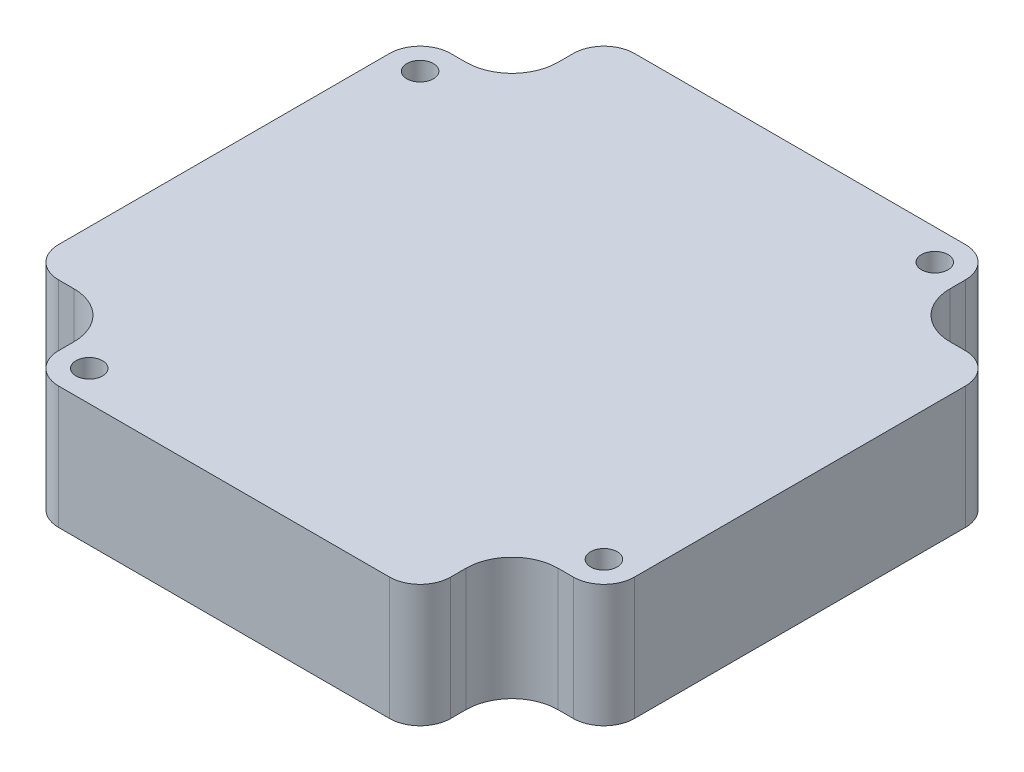
ISO-10303-21;
HEADER;
FILE_DESCRIPTION(('STEP AP214'),'2;1');
FILE_NAME('part.step','',(''),(''),'','','');
FILE_SCHEMA(('AUTOMOTIVE_DESIGN { 1 0 10303 214 1 1 1 1 }'));
ENDSEC;
DATA;
#1=APPLICATION_CONTEXT('core data for automotive mechanical design processes');
#2=APPLICATION_PROTOCOL_DEFINITION('international standard','automotive_design',2000,#1);
#3=PRODUCT_CONTEXT('',#1,'mechanical');
#4=PRODUCT('Part','Part','',(#3));
#5=PRODUCT_RELATED_PRODUCT_CATEGORY('part','',(#4));
#6=PRODUCT_DEFINITION_FORMATION('','',#4);
#7=PRODUCT_DEFINITION_CONTEXT('part definition',#1,'design');
#8=PRODUCT_DEFINITION('design','',#6,#7);
#9=PRODUCT_DEFINITION_SHAPE('','',#8);
#10=(LENGTH_UNIT() NAMED_UNIT(*) SI_UNIT(.MILLI.,.METRE.));
#11=(NAMED_UNIT(*) PLANE_ANGLE_UNIT() SI_UNIT($,.RADIAN.));
#12=(NAMED_UNIT(*) SI_UNIT($,.STERADIAN.) SOLID_ANGLE_UNIT());
#13=UNCERTAINTY_MEASURE_WITH_UNIT(LENGTH_MEASURE(1.E-05),#10,'distance_accuracy_value','');
#14=(GEOMETRIC_REPRESENTATION_CONTEXT(3) GLOBAL_UNCERTAINTY_ASSIGNED_CONTEXT((#13)) GLOBAL_UNIT_ASSIGNED_CONTEXT((#10,
#11,#12)) REPRESENTATION_CONTEXT('',''));
#15=CARTESIAN_POINT('',(0.,0.,0.));
#16=DIRECTION('',(0.,0.,1.));
#17=DIRECTION('',(1.,0.,0.));
#18=AXIS2_PLACEMENT_3D('',#15,#16,#17);
#19=CARTESIAN_POINT('',(0.,-62.7,0.));
#20=DIRECTION('',(0.,-1.,0.));
#21=DIRECTION('',(0.,0.,-1.));
#22=AXIS2_PLACEMENT_3D('',#19,#20,#21);
#23=PLANE('',#22);
#24=CARTESIAN_POINT('',(0.,-62.7,0.));
#25=DIRECTION('',(0.,-1.,0.));
#26=DIRECTION('',(0.,0.,-1.));
#27=AXIS2_PLACEMENT_3D('',#24,#25,#26);
#28=CIRCLE('',#27,5.);
#29=CARTESIAN_POINT('',(0.,-62.7,-5.));
#30=VERTEX_POINT('',#29);
#31=EDGE_CURVE('E20',#30,#30,#28,.T.);
#32=ORIENTED_EDGE('',*,*,#31,.T.);
#33=EDGE_LOOP('',(#32));
#34=FACE_BOUND('',#33,.T.);
#35=ADVANCED_FACE('F17',(#34),#23,.T.);
#36=CARTESIAN_POINT('',(0.,-62.7,0.));
#37=DIRECTION('',(0.,-1.,0.));
#38=DIRECTION('',(0.,0.,-1.));
#39=AXIS2_PLACEMENT_3D('',#36,#37,#38);
#40=CYLINDRICAL_SURFACE('',#39,5.);
#41=CARTESIAN_POINT('',(0.,-65.,0.));
#42=DIRECTION('',(0.,-1.,0.));
#43=DIRECTION('',(0.,0.,-1.));
#44=AXIS2_PLACEMENT_3D('',#41,#42,#43);
#45=CIRCLE('',#44,5.);
#46=CARTESIAN_POINT('',(0.,-65.,-5.));
#47=VERTEX_POINT('',#46);
#48=EDGE_CURVE('E227',#47,#47,#45,.F.);
#49=ORIENTED_EDGE('',*,*,#48,.F.);
#50=EDGE_LOOP('',(#49));
#51=FACE_BOUND('',#50,.T.);
#52=ORIENTED_EDGE('',*,*,#31,.F.);
#53=EDGE_LOOP('',(#52));
#54=FACE_BOUND('',#53,.T.);
#55=ADVANCED_FACE('F358',(#51,#54),#40,.F.);
#56=CARTESIAN_POINT('',(-19.2,-65.,25.2));
#57=DIRECTION('',(1.,0.,0.));
#58=DIRECTION('',(0.,0.,-1.));
#59=AXIS2_PLACEMENT_3D('',#56,#57,#58);
#60=PLANE('',#59);
#61=DIRECTION('',(0.,1.,0.));
#62=VECTOR('',#61,1.);
#63=CARTESIAN_POINT('',(-19.2,-65.,23.7));
#64=LINE('',#63,#62);
#65=CARTESIAN_POINT('',(-19.2,-53.,23.7));
#66=VERTEX_POINT('',#65);
#67=CARTESIAN_POINT('',(-19.2,-65.,23.7));
#68=VERTEX_POINT('',#67);
#69=EDGE_CURVE('E202',#66,#68,#64,.F.);
#70=ORIENTED_EDGE('',*,*,#69,.T.);
#71=DIRECTION('',(0.,0.,-1.));
#72=VECTOR('',#71,1.);
#73=CARTESIAN_POINT('',(-19.2,-65.,25.1999999999999));
#74=LINE('',#73,#72);
#75=CARTESIAN_POINT('',(-19.2,-65.,25.2));
#76=VERTEX_POINT('',#75);
#77=EDGE_CURVE('E226',#76,#68,#74,.T.);
#78=ORIENTED_EDGE('',*,*,#77,.F.);
#79=DIRECTION('',(0.,1.,0.));
#80=VECTOR('',#79,1.);
#81=CARTESIAN_POINT('',(-19.2,-65.,25.2));
#82=LINE('',#81,#80);
#83=CARTESIAN_POINT('',(-19.2,-53.,25.2));
#84=VERTEX_POINT('',#83);
#85=EDGE_CURVE('E176',#84,#76,#82,.F.);
#86=ORIENTED_EDGE('',*,*,#85,.F.);
#87=DIRECTION('',(0.,0.,-1.));
#88=VECTOR('',#87,1.);
#89=CARTESIAN_POINT('',(-19.2,-53.,25.2));
#90=LINE('',#89,#88);
#91=EDGE_CURVE('E256',#66,#84,#90,.F.);
#92=ORIENTED_EDGE('',*,*,#91,.F.);
#93=EDGE_LOOP('',(#70,#78,#86,#92));
#94=FACE_BOUND('',#93,.T.);
#95=ADVANCED_FACE('F361',(#94),#60,.F.);
#96=CARTESIAN_POINT('',(-23.7,-65.,19.2));
#97=DIRECTION('',(0.,0.,-1.));
#98=DIRECTION('',(-1.,0.,0.));
#99=AXIS2_PLACEMENT_3D('',#96,#97,#98);
#100=PLANE('',#99);
#101=DIRECTION('',(0.,1.,0.));
#102=VECTOR('',#101,1.);
#103=CARTESIAN_POINT('',(-25.2,-65.,19.2));
#104=LINE('',#103,#102);
#105=CARTESIAN_POINT('',(-25.2,-65.,19.2));
#106=VERTEX_POINT('',#105);
#107=CARTESIAN_POINT('',(-25.2,-53.,19.2));
#108=VERTEX_POINT('',#107);
#109=EDGE_CURVE('E341',#106,#108,#104,.T.);
#110=ORIENTED_EDGE('',*,*,#109,.F.);
#111=DIRECTION('',(1.,0.,0.));
#112=VECTOR('',#111,1.);
#113=CARTESIAN_POINT('',(16.2000000000001,-65.,19.2));
#114=LINE('',#113,#112);
#115=CARTESIAN_POINT('',(-23.7,-65.,19.2));
#116=VERTEX_POINT('',#115);
#117=EDGE_CURVE('E224',#116,#106,#114,.F.);
#118=ORIENTED_EDGE('',*,*,#117,.F.);
#119=DIRECTION('',(0.,1.,0.));
#120=VECTOR('',#119,1.);
#121=CARTESIAN_POINT('',(-23.7,-65.,19.2));
#122=LINE('',#121,#120);
#123=CARTESIAN_POINT('',(-23.7,-53.,19.2));
#124=VERTEX_POINT('',#123);
#125=EDGE_CURVE('E342',#116,#124,#122,.T.);
#126=ORIENTED_EDGE('',*,*,#125,.T.);
#127=DIRECTION('',(-1.,0.,0.));
#128=VECTOR('',#127,1.);
#129=CARTESIAN_POINT('',(-23.7,-53.,19.2));
#130=LINE('',#129,#128);
#131=EDGE_CURVE('E249',#108,#124,#130,.F.);
#132=ORIENTED_EDGE('',*,*,#131,.F.);
#133=EDGE_LOOP('',(#110,#118,#126,#132));
#134=FACE_BOUND('',#133,.T.);
#135=ADVANCED_FACE('F477',(#134),#100,.F.);
#136=CARTESIAN_POINT('',(-25.2000000000002,-65.,-19.1999999999996));
#137=DIRECTION('',(0.,0.,1.));
#138=DIRECTION('',(1.,0.,0.));
#139=AXIS2_PLACEMENT_3D('',#136,#137,#138);
#140=PLANE('',#139);
#141=DIRECTION('',(0.,1.,0.));
#142=VECTOR('',#141,1.);
#143=CARTESIAN_POINT('',(-23.7000000000003,-65.,-19.1999999999997));
#144=LINE('',#143,#142);
#145=CARTESIAN_POINT('',(-23.7000000000001,-53.,-19.1999999999997));
#146=VERTEX_POINT('',#145);
#147=CARTESIAN_POINT('',(-23.7000000000003,-65.,-19.1999999999997));
#148=VERTEX_POINT('',#147);
#149=EDGE_CURVE('E334',#146,#148,#144,.F.);
#150=ORIENTED_EDGE('',*,*,#149,.T.);
#151=DIRECTION('',(1.,0.,0.));
#152=VECTOR('',#151,1.);
#153=CARTESIAN_POINT('',(16.2000000000001,-65.,-19.1999999999996));
#154=LINE('',#153,#152);
#155=CARTESIAN_POINT('',(-25.2000000000002,-65.,-19.1999999999996));
#156=VERTEX_POINT('',#155);
#157=EDGE_CURVE('E222',#156,#148,#154,.T.);
#158=ORIENTED_EDGE('',*,*,#157,.F.);
#159=DIRECTION('',(0.,1.,0.));
#160=VECTOR('',#159,1.);
#161=CARTESIAN_POINT('',(-25.2000000000002,-65.,-19.1999999999996));
#162=LINE('',#161,#160);
#163=CARTESIAN_POINT('',(-25.2000000000003,-53.,-19.1999999999996));
#164=VERTEX_POINT('',#163);
#165=EDGE_CURVE('E253',#164,#156,#162,.F.);
#166=ORIENTED_EDGE('',*,*,#165,.F.);
#167=DIRECTION('',(1.,0.,0.));
#168=VECTOR('',#167,1.);
#169=CARTESIAN_POINT('',(-25.2000000000002,-53.,-19.1999999999996));
#170=LINE('',#169,#168);
#171=EDGE_CURVE('E247',#146,#164,#170,.F.);
#172=ORIENTED_EDGE('',*,*,#171,.F.);
#173=EDGE_LOOP('',(#150,#158,#166,#172));
#174=FACE_BOUND('',#173,.T.);
#175=ADVANCED_FACE('F473',(#174),#140,.F.);
#176=CARTESIAN_POINT('',(-19.2000000000003,-65.,-23.6999999999998));
#177=DIRECTION('',(1.,0.,0.));
#178=DIRECTION('',(0.,0.,-1.));
#179=AXIS2_PLACEMENT_3D('',#176,#177,#178);
#180=PLANE('',#179);
#181=DIRECTION('',(0.,1.,0.));
#182=VECTOR('',#181,1.);
#183=CARTESIAN_POINT('',(-19.2000000000003,-65.,-25.1999999999998));
#184=LINE('',#183,#182);
#185=CARTESIAN_POINT('',(-19.2000000000003,-65.,-25.1999999999998));
#186=VERTEX_POINT('',#185);
#187=CARTESIAN_POINT('',(-19.2000000000003,-53.,-25.1999999999998));
#188=VERTEX_POINT('',#187);
#189=EDGE_CURVE('E329',#186,#188,#184,.T.);
#190=ORIENTED_EDGE('',*,*,#189,.F.);
#191=DIRECTION('',(0.,0.,-1.));
#192=VECTOR('',#191,1.);
#193=CARTESIAN_POINT('',(-19.2000000000003,-65.,25.1999999999999));
#194=LINE('',#193,#192);
#195=CARTESIAN_POINT('',(-19.2000000000003,-65.,-23.6999999999998));
#196=VERTEX_POINT('',#195);
#197=EDGE_CURVE('E220',#196,#186,#194,.T.);
#198=ORIENTED_EDGE('',*,*,#197,.F.);
#199=DIRECTION('',(0.,1.,0.));
#200=VECTOR('',#199,1.);
#201=CARTESIAN_POINT('',(-19.2000000000003,-65.,-23.6999999999998));
#202=LINE('',#201,#200);
#203=CARTESIAN_POINT('',(-19.2000000000003,-53.,-23.6999999999999));
#204=VERTEX_POINT('',#203);
#205=EDGE_CURVE('E330',#196,#204,#202,.T.);
#206=ORIENTED_EDGE('',*,*,#205,.T.);
#207=DIRECTION('',(0.,0.,-1.));
#208=VECTOR('',#207,1.);
#209=CARTESIAN_POINT('',(-19.2000000000003,-53.,-23.6999999999998));
#210=LINE('',#209,#208);
#211=EDGE_CURVE('E240',#188,#204,#210,.F.);
#212=ORIENTED_EDGE('',*,*,#211,.F.);
#213=EDGE_LOOP('',(#190,#198,#206,#212));
#214=FACE_BOUND('',#213,.T.);
#215=ADVANCED_FACE('F469',(#214),#180,.F.);
#216=CARTESIAN_POINT('',(19.1999999999997,-65.,-25.2000000000001));
#217=DIRECTION('',(-1.,0.,0.));
#218=DIRECTION('',(0.,0.,1.));
#219=AXIS2_PLACEMENT_3D('',#216,#217,#218);
#220=PLANE('',#219);
#221=DIRECTION('',(0.,1.,0.));
#222=VECTOR('',#221,1.);
#223=CARTESIAN_POINT('',(19.1999999999998,-65.,-23.7000000000001));
#224=LINE('',#223,#222);
#225=CARTESIAN_POINT('',(19.1999999999998,-53.,-23.7));
#226=VERTEX_POINT('',#225);
#227=CARTESIAN_POINT('',(19.1999999999998,-65.,-23.7000000000002));
#228=VERTEX_POINT('',#227);
#229=EDGE_CURVE('E322',#226,#228,#224,.F.);
#230=ORIENTED_EDGE('',*,*,#229,.T.);
#231=DIRECTION('',(0.,0.,-1.));
#232=VECTOR('',#231,1.);
#233=CARTESIAN_POINT('',(19.1999999999997,-65.,25.1999999999999));
#234=LINE('',#233,#232);
#235=CARTESIAN_POINT('',(19.1999999999997,-65.,-25.2000000000001));
#236=VERTEX_POINT('',#235);
#237=EDGE_CURVE('E218',#236,#228,#234,.F.);
#238=ORIENTED_EDGE('',*,*,#237,.F.);
#239=DIRECTION('',(0.,1.,0.));
#240=VECTOR('',#239,1.);
#241=CARTESIAN_POINT('',(19.1999999999997,-65.,-25.2000000000001));
#242=LINE('',#241,#240);
#243=CARTESIAN_POINT('',(19.1999999999997,-53.,-25.2000000000002));
#244=VERTEX_POINT('',#243);
#245=EDGE_CURVE('E244',#244,#236,#242,.F.);
#246=ORIENTED_EDGE('',*,*,#245,.F.);
#247=DIRECTION('',(0.,0.,1.));
#248=VECTOR('',#247,1.);
#249=CARTESIAN_POINT('',(19.1999999999997,-53.,-25.2000000000001));
#250=LINE('',#249,#248);
#251=EDGE_CURVE('E238',#226,#244,#250,.F.);
#252=ORIENTED_EDGE('',*,*,#251,.F.);
#253=EDGE_LOOP('',(#230,#238,#246,#252));
#254=FACE_BOUND('',#253,.T.);
#255=ADVANCED_FACE('F465',(#254),#220,.F.);
#256=CARTESIAN_POINT('',(23.6999999999999,-65.,-19.2000000000002));
#257=DIRECTION('',(0.,0.,1.));
#258=DIRECTION('',(1.,0.,0.));
#259=AXIS2_PLACEMENT_3D('',#256,#257,#258);
#260=PLANE('',#259);
#261=DIRECTION('',(0.,1.,0.));
#262=VECTOR('',#261,1.);
#263=CARTESIAN_POINT('',(25.1999999999999,-65.,-19.2000000000002));
#264=LINE('',#263,#262);
#265=CARTESIAN_POINT('',(25.1999999999999,-65.,-19.2000000000002));
#266=VERTEX_POINT('',#265);
#267=CARTESIAN_POINT('',(25.1999999999998,-53.,-19.2000000000002));
#268=VERTEX_POINT('',#267);
#269=EDGE_CURVE('E317',#266,#268,#264,.T.);
#270=ORIENTED_EDGE('',*,*,#269,.F.);
#271=DIRECTION('',(1.,0.,0.));
#272=VECTOR('',#271,1.);
#273=CARTESIAN_POINT('',(16.2000000000001,-65.,-19.2000000000002));
#274=LINE('',#273,#272);
#275=CARTESIAN_POINT('',(23.6999999999998,-65.,-19.2000000000002));
#276=VERTEX_POINT('',#275);
#277=EDGE_CURVE('E216',#276,#266,#274,.T.);
#278=ORIENTED_EDGE('',*,*,#277,.F.);
#279=DIRECTION('',(0.,1.,0.));
#280=VECTOR('',#279,1.);
#281=CARTESIAN_POINT('',(23.6999999999998,-65.,-19.2000000000002));
#282=LINE('',#281,#280);
#283=CARTESIAN_POINT('',(23.6999999999999,-53.,-19.2000000000002));
#284=VERTEX_POINT('',#283);
#285=EDGE_CURVE('E318',#276,#284,#282,.T.);
#286=ORIENTED_EDGE('',*,*,#285,.T.);
#287=DIRECTION('',(1.,0.,0.));
#288=VECTOR('',#287,1.);
#289=CARTESIAN_POINT('',(23.6999999999999,-53.,-19.2000000000002));
#290=LINE('',#289,#288);
#291=EDGE_CURVE('E231',#268,#284,#290,.F.);
#292=ORIENTED_EDGE('',*,*,#291,.F.);
#293=EDGE_LOOP('',(#270,#278,#286,#292));
#294=FACE_BOUND('',#293,.T.);
#295=ADVANCED_FACE('F461',(#294),#260,.F.);
#296=CARTESIAN_POINT('',(25.2000000000001,-65.,19.1999999999999));
#297=DIRECTION('',(0.,0.,-1.));
#298=DIRECTION('',(-1.,0.,0.));
#299=AXIS2_PLACEMENT_3D('',#296,#297,#298);
#300=PLANE('',#299);
#301=DIRECTION('',(0.,1.,0.));
#302=VECTOR('',#301,1.);
#303=CARTESIAN_POINT('',(23.7000000000001,-65.,19.1999999999999));
#304=LINE('',#303,#302);
#305=CARTESIAN_POINT('',(23.7000000000001,-53.,19.1999999999999));
#306=VERTEX_POINT('',#305);
#307=CARTESIAN_POINT('',(23.7000000000001,-65.,19.1999999999999));
#308=VERTEX_POINT('',#307);
#309=EDGE_CURVE('E310',#306,#308,#304,.F.);
#310=ORIENTED_EDGE('',*,*,#309,.T.);
#311=DIRECTION('',(1.,0.,0.));
#312=VECTOR('',#311,1.);
#313=CARTESIAN_POINT('',(16.2000000000001,-65.,19.1999999999999));
#314=LINE('',#313,#312);
#315=CARTESIAN_POINT('',(25.2000000000001,-65.,19.1999999999999));
#316=VERTEX_POINT('',#315);
#317=EDGE_CURVE('E214',#316,#308,#314,.F.);
#318=ORIENTED_EDGE('',*,*,#317,.F.);
#319=DIRECTION('',(0.,1.,0.));
#320=VECTOR('',#319,1.);
#321=CARTESIAN_POINT('',(25.2000000000001,-65.,19.1999999999999));
#322=LINE('',#321,#320);
#323=CARTESIAN_POINT('',(25.2000000000001,-53.,19.1999999999999));
#324=VERTEX_POINT('',#323);
#325=EDGE_CURVE('E235',#324,#316,#322,.F.);
#326=ORIENTED_EDGE('',*,*,#325,.F.);
#327=DIRECTION('',(-1.,0.,0.));
#328=VECTOR('',#327,1.);
#329=CARTESIAN_POINT('',(25.2000000000001,-53.,19.1999999999999));
#330=LINE('',#329,#328);
#331=EDGE_CURVE('E229',#306,#324,#330,.F.);
#332=ORIENTED_EDGE('',*,*,#331,.F.);
#333=EDGE_LOOP('',(#310,#318,#326,#332));
#334=FACE_BOUND('',#333,.T.);
#335=ADVANCED_FACE('F458',(#334),#300,.F.);
#336=CARTESIAN_POINT('',(16.2000000000001,-65.,25.1999999999999));
#337=DIRECTION('',(0.,-1.,0.));
#338=DIRECTION('',(0.,0.,-1.));
#339=AXIS2_PLACEMENT_3D('',#336,#337,#338);
#340=PLANE('',#339);
#341=CARTESIAN_POINT('',(23.7000000000001,-65.,23.6999999999999));
#342=DIRECTION('',(0.,1.,0.));
#343=DIRECTION('',(0.,0.,1.));
#344=AXIS2_PLACEMENT_3D('',#341,#342,#343);
#345=CIRCLE('',#344,4.5);
#346=CARTESIAN_POINT('',(19.2000000000001,-65.,23.6999999999999));
#347=VERTEX_POINT('',#346);
#348=EDGE_CURVE('E307',#308,#347,#345,.T.);
#349=ORIENTED_EDGE('',*,*,#348,.T.);
#350=DIRECTION('',(0.,0.,1.));
#351=VECTOR('',#350,1.);
#352=CARTESIAN_POINT('',(19.2000000000001,-65.,23.6999999999999));
#353=LINE('',#352,#351);
#354=CARTESIAN_POINT('',(19.2000000000001,-65.,25.1999999999999));
#355=VERTEX_POINT('',#354);
#356=EDGE_CURVE('E212',#347,#355,#353,.T.);
#357=ORIENTED_EDGE('',*,*,#356,.T.);
#358=CARTESIAN_POINT('',(16.2000000000001,-65.,25.1999999999999));
#359=DIRECTION('',(0.,1.,0.));
#360=DIRECTION('',(0.,0.,1.));
#361=AXIS2_PLACEMENT_3D('',#358,#359,#360);
#362=CIRCLE('',#361,3.);
#363=CARTESIAN_POINT('',(16.2000000000001,-65.,28.1999999999999));
#364=VERTEX_POINT('',#363);
#365=EDGE_CURVE('E193',#364,#355,#362,.T.);
#366=ORIENTED_EDGE('',*,*,#365,.F.);
#367=DIRECTION('',(-1.,0.,0.));
#368=VECTOR('',#367,1.);
#369=CARTESIAN_POINT('',(16.2000000000001,-65.,28.1999999999999));
#370=LINE('',#369,#368);
#371=CARTESIAN_POINT('',(-16.2,-65.,28.2));
#372=VERTEX_POINT('',#371);
#373=EDGE_CURVE('E188',#364,#372,#370,.T.);
#374=ORIENTED_EDGE('',*,*,#373,.T.);
#375=CARTESIAN_POINT('',(-16.2,-65.,25.2));
#376=DIRECTION('',(0.,1.,0.));
#377=DIRECTION('',(0.,0.,1.));
#378=AXIS2_PLACEMENT_3D('',#375,#376,#377);
#379=CIRCLE('',#378,3.);
#380=EDGE_CURVE('E179',#76,#372,#379,.T.);
#381=ORIENTED_EDGE('',*,*,#380,.F.);
#382=ORIENTED_EDGE('',*,*,#77,.T.);
#383=CARTESIAN_POINT('',(-23.7,-65.,23.7));
#384=DIRECTION('',(0.,1.,0.));
#385=DIRECTION('',(0.,0.,1.));
#386=AXIS2_PLACEMENT_3D('',#383,#384,#385);
#387=CIRCLE('',#386,4.5);
#388=EDGE_CURVE('E205',#68,#116,#387,.T.);
#389=ORIENTED_EDGE('',*,*,#388,.T.);
#390=ORIENTED_EDGE('',*,*,#117,.T.);
#391=CARTESIAN_POINT('',(-25.2,-65.,16.2));
#392=DIRECTION('',(0.,1.,0.));
#393=DIRECTION('',(0.,0.,1.));
#394=AXIS2_PLACEMENT_3D('',#391,#392,#393);
#395=CIRCLE('',#394,3.);
#396=CARTESIAN_POINT('',(-28.2,-65.,16.2));
#397=VERTEX_POINT('',#396);
#398=EDGE_CURVE('E338',#397,#106,#395,.T.);
#399=ORIENTED_EDGE('',*,*,#398,.F.);
#400=DIRECTION('',(0.,0.,-1.));
#401=VECTOR('',#400,1.);
#402=CARTESIAN_POINT('',(-28.2,-65.,16.2));
#403=LINE('',#402,#401);
#404=CARTESIAN_POINT('',(-28.2,-65.,-16.1999999999997));
#405=VERTEX_POINT('',#404);
#406=EDGE_CURVE('E250',#397,#405,#403,.T.);
#407=ORIENTED_EDGE('',*,*,#406,.T.);
#408=CARTESIAN_POINT('',(-25.2000000000002,-65.,-16.1999999999997));
#409=DIRECTION('',(0.,1.,0.));
#410=DIRECTION('',(0.,0.,1.));
#411=AXIS2_PLACEMENT_3D('',#408,#409,#410);
#412=CIRCLE('',#411,2.99999999999987);
#413=EDGE_CURVE('E335',#156,#405,#412,.T.);
#414=ORIENTED_EDGE('',*,*,#413,.F.);
#415=ORIENTED_EDGE('',*,*,#157,.T.);
#416=CARTESIAN_POINT('',(-23.7000000000003,-65.,-23.6999999999997));
#417=DIRECTION('',(0.,1.,0.));
#418=DIRECTION('',(0.,0.,1.));
#419=AXIS2_PLACEMENT_3D('',#416,#417,#418);
#420=CIRCLE('',#419,4.5);
#421=EDGE_CURVE('E331',#148,#196,#420,.T.);
#422=ORIENTED_EDGE('',*,*,#421,.T.);
#423=ORIENTED_EDGE('',*,*,#197,.T.);
#424=CARTESIAN_POINT('',(-16.2000000000003,-65.,-25.1999999999998));
#425=DIRECTION('',(0.,1.,0.));
#426=DIRECTION('',(0.,0.,1.));
#427=AXIS2_PLACEMENT_3D('',#424,#425,#426);
#428=CIRCLE('',#427,3.00000000000006);
#429=CARTESIAN_POINT('',(-16.2000000000003,-65.,-28.1999999999999));
#430=VERTEX_POINT('',#429);
#431=EDGE_CURVE('E326',#430,#186,#428,.T.);
#432=ORIENTED_EDGE('',*,*,#431,.F.);
#433=DIRECTION('',(1.,0.,0.));
#434=VECTOR('',#433,1.);
#435=CARTESIAN_POINT('',(-16.2000000000003,-65.,-28.1999999999999));
#436=LINE('',#435,#434);
#437=CARTESIAN_POINT('',(16.1999999999998,-65.,-28.2));
#438=VERTEX_POINT('',#437);
#439=EDGE_CURVE('E241',#430,#438,#436,.T.);
#440=ORIENTED_EDGE('',*,*,#439,.T.);
#441=CARTESIAN_POINT('',(16.1999999999998,-65.,-25.2000000000001));
#442=DIRECTION('',(0.,1.,0.));
#443=DIRECTION('',(0.,0.,1.));
#444=AXIS2_PLACEMENT_3D('',#441,#442,#443);
#445=CIRCLE('',#444,2.99999999999991);
#446=EDGE_CURVE('E323',#236,#438,#445,.T.);
#447=ORIENTED_EDGE('',*,*,#446,.F.);
#448=ORIENTED_EDGE('',*,*,#237,.T.);
#449=CARTESIAN_POINT('',(23.6999999999998,-65.,-23.7000000000002));
#450=DIRECTION('',(0.,1.,0.));
#451=DIRECTION('',(0.,0.,1.));
#452=AXIS2_PLACEMENT_3D('',#449,#450,#451);
#453=CIRCLE('',#452,4.5);
#454=EDGE_CURVE('E319',#228,#276,#453,.T.);
#455=ORIENTED_EDGE('',*,*,#454,.T.);
#456=ORIENTED_EDGE('',*,*,#277,.T.);
#457=CARTESIAN_POINT('',(25.1999999999999,-65.,-16.2000000000002));
#458=DIRECTION('',(0.,1.,0.));
#459=DIRECTION('',(0.,0.,1.));
#460=AXIS2_PLACEMENT_3D('',#457,#458,#459);
#461=CIRCLE('',#460,3.00000000000005);
#462=CARTESIAN_POINT('',(28.1999999999999,-65.,-16.2000000000002));
#463=VERTEX_POINT('',#462);
#464=EDGE_CURVE('E314',#463,#266,#461,.T.);
#465=ORIENTED_EDGE('',*,*,#464,.F.);
#466=DIRECTION('',(0.,0.,1.));
#467=VECTOR('',#466,1.);
#468=CARTESIAN_POINT('',(28.1999999999999,-65.,-16.2000000000002));
#469=LINE('',#468,#467);
#470=CARTESIAN_POINT('',(28.2000000000001,-65.,16.1999999999999));
#471=VERTEX_POINT('',#470);
#472=EDGE_CURVE('E232',#463,#471,#469,.T.);
#473=ORIENTED_EDGE('',*,*,#472,.T.);
#474=CARTESIAN_POINT('',(25.2000000000001,-65.,16.1999999999999));
#475=DIRECTION('',(0.,1.,0.));
#476=DIRECTION('',(0.,0.,1.));
#477=AXIS2_PLACEMENT_3D('',#474,#475,#476);
#478=CIRCLE('',#477,3.);
#479=EDGE_CURVE('E311',#316,#471,#478,.T.);
#480=ORIENTED_EDGE('',*,*,#479,.F.);
#481=ORIENTED_EDGE('',*,*,#317,.T.);
#482=EDGE_LOOP('',(#349,#357,#366,#374,#381,#382,#389,#390,#399,#407,#414,#415,#422,#423,#432,
#440,#447,#448,#455,#456,#465,#473,#480,#481));
#483=FACE_BOUND('',#482,.T.);
#484=ORIENTED_EDGE('',*,*,#48,.T.);
#485=EDGE_LOOP('',(#484));
#486=FACE_BOUND('',#485,.T.);
#487=CARTESIAN_POINT('',(-25.199999999999,-65.,-16.2000000000013));
#488=DIRECTION('',(0.,-1.,0.));
#489=DIRECTION('',(0.,0.,-1.));
#490=AXIS2_PLACEMENT_3D('',#487,#488,#489);
#491=CIRCLE('',#490,1.30000000000052);
#492=CARTESIAN_POINT('',(-25.199999999999,-65.,-17.5000000000018));
#493=VERTEX_POINT('',#492);
#494=EDGE_CURVE('E197',#493,#493,#491,.F.);
#495=ORIENTED_EDGE('',*,*,#494,.T.);
#496=EDGE_LOOP('',(#495));
#497=FACE_BOUND('',#496,.T.);
#498=CARTESIAN_POINT('',(-16.2000000000001,-65.,25.1999999999988));
#499=DIRECTION('',(0.,-1.,0.));
#500=DIRECTION('',(0.,0.,-1.));
#501=AXIS2_PLACEMENT_3D('',#498,#499,#500);
#502=CIRCLE('',#501,1.30000000000113);
#503=CARTESIAN_POINT('',(-16.2000000000001,-65.,23.8999999999976));
#504=VERTEX_POINT('',#503);
#505=EDGE_CURVE('E347',#504,#504,#502,.F.);
#506=ORIENTED_EDGE('',*,*,#505,.T.);
#507=EDGE_LOOP('',(#506));
#508=FACE_BOUND('',#507,.T.);
#509=CARTESIAN_POINT('',(16.2000000000011,-65.,-25.2000000000002));
#510=DIRECTION('',(0.,-1.,0.));
#511=DIRECTION('',(0.,0.,-1.));
#512=AXIS2_PLACEMENT_3D('',#509,#510,#511);
#513=CIRCLE('',#512,1.29999999999944);
#514=CARTESIAN_POINT('',(16.2000000000011,-65.,-26.4999999999996));
#515=VERTEX_POINT('',#514);
#516=EDGE_CURVE('E350',#515,#515,#513,.F.);
#517=ORIENTED_EDGE('',*,*,#516,.T.);
#518=EDGE_LOOP('',(#517));
#519=FACE_BOUND('',#518,.T.);
#520=CARTESIAN_POINT('',(25.1999999999999,-65.,16.1999999999999));
#521=DIRECTION('',(0.,-1.,0.));
#522=DIRECTION('',(0.,0.,-1.));
#523=AXIS2_PLACEMENT_3D('',#520,#521,#522);
#524=CIRCLE('',#523,1.3);
#525=CARTESIAN_POINT('',(25.1999999999999,-65.,14.8999999999999));
#526=VERTEX_POINT('',#525);
#527=EDGE_CURVE('E211',#526,#526,#524,.F.);
#528=ORIENTED_EDGE('',*,*,#527,.T.);
#529=EDGE_LOOP('',(#528));
#530=FACE_BOUND('',#529,.T.);
#531=ADVANCED_FACE('F190',(#483,#486,#497,#508,#519,#530),#340,.T.);
#532=CARTESIAN_POINT('',(19.2000000000001,-65.,23.6999999999999));
#533=DIRECTION('',(-1.,0.,0.));
#534=DIRECTION('',(0.,0.,1.));
#535=AXIS2_PLACEMENT_3D('',#532,#533,#534);
#536=PLANE('',#535);
#537=DIRECTION('',(0.,1.,0.));
#538=VECTOR('',#537,1.);
#539=CARTESIAN_POINT('',(19.2000000000001,-65.,25.1999999999999));
#540=LINE('',#539,#538);
#541=CARTESIAN_POINT('',(19.2000000000001,-53.,25.1999999999999));
#542=VERTEX_POINT('',#541);
#543=EDGE_CURVE('E304',#355,#542,#540,.T.);
#544=ORIENTED_EDGE('',*,*,#543,.F.);
#545=ORIENTED_EDGE('',*,*,#356,.F.);
#546=DIRECTION('',(0.,1.,0.));
#547=VECTOR('',#546,1.);
#548=CARTESIAN_POINT('',(19.2000000000001,-65.,23.6999999999999));
#549=LINE('',#548,#547);
#550=CARTESIAN_POINT('',(19.2000000000001,-53.,23.6999999999999));
#551=VERTEX_POINT('',#550);
#552=EDGE_CURVE('E309',#347,#551,#549,.T.);
#553=ORIENTED_EDGE('',*,*,#552,.T.);
#554=DIRECTION('',(0.,0.,1.));
#555=VECTOR('',#554,1.);
#556=CARTESIAN_POINT('',(19.2000000000001,-53.,23.6999999999999));
#557=LINE('',#556,#555);
#558=EDGE_CURVE('E35',#542,#551,#557,.F.);
#559=ORIENTED_EDGE('',*,*,#558,.F.);
#560=EDGE_LOOP('',(#544,#545,#553,#559));
#561=FACE_BOUND('',#560,.T.);
#562=ADVANCED_FACE('F452',(#561),#536,.F.);
#563=CARTESIAN_POINT('',(25.1999999999999,31.6,16.1999999999999));
#564=DIRECTION('',(0.,-1.,0.));
#565=DIRECTION('',(0.,0.,-1.));
#566=AXIS2_PLACEMENT_3D('',#563,#564,#565);
#567=CYLINDRICAL_SURFACE('',#566,1.3);
#568=CARTESIAN_POINT('',(25.1999999999999,-53.,16.1999999999999));
#569=DIRECTION('',(0.,-1.,0.));
#570=DIRECTION('',(0.,0.,-1.));
#571=AXIS2_PLACEMENT_3D('',#568,#569,#570);
#572=CIRCLE('',#571,1.3);
#573=CARTESIAN_POINT('',(25.1999999999999,-53.,14.8999999999999));
#574=VERTEX_POINT('',#573);
#575=EDGE_CURVE('E301',#574,#574,#572,.F.);
#576=ORIENTED_EDGE('',*,*,#575,.T.);
#577=EDGE_LOOP('',(#576));
#578=FACE_BOUND('',#577,.T.);
#579=ORIENTED_EDGE('',*,*,#527,.F.);
#580=EDGE_LOOP('',(#579));
#581=FACE_BOUND('',#580,.T.);
#582=ADVANCED_FACE('F448',(#578,#581),#567,.F.);
#583=CARTESIAN_POINT('',(16.2000000000011,31.6,-25.2000000000002));
#584=DIRECTION('',(0.,-1.,0.));
#585=DIRECTION('',(0.,0.,-1.));
#586=AXIS2_PLACEMENT_3D('',#583,#584,#585);
#587=CYLINDRICAL_SURFACE('',#586,1.29999999999944);
#588=CARTESIAN_POINT('',(16.2000000000011,-53.,-25.2000000000002));
#589=DIRECTION('',(0.,-1.,0.));
#590=DIRECTION('',(0.,0.,-1.));
#591=AXIS2_PLACEMENT_3D('',#588,#589,#590);
#592=CIRCLE('',#591,1.29999999999944);
#593=CARTESIAN_POINT('',(16.2000000000011,-53.,-26.4999999999996));
#594=VERTEX_POINT('',#593);
#595=EDGE_CURVE('E298',#594,#594,#592,.F.);
#596=ORIENTED_EDGE('',*,*,#595,.T.);
#597=EDGE_LOOP('',(#596));
#598=FACE_BOUND('',#597,.T.);
#599=ORIENTED_EDGE('',*,*,#516,.F.);
#600=EDGE_LOOP('',(#599));
#601=FACE_BOUND('',#600,.T.);
#602=ADVANCED_FACE('F444',(#598,#601),#587,.F.);
#603=CARTESIAN_POINT('',(-16.2000000000001,31.6,25.1999999999988));
#604=DIRECTION('',(0.,-1.,0.));
#605=DIRECTION('',(0.,0.,-1.));
#606=AXIS2_PLACEMENT_3D('',#603,#604,#605);
#607=CYLINDRICAL_SURFACE('',#606,1.30000000000113);
#608=CARTESIAN_POINT('',(-16.2000000000001,-53.,25.1999999999988));
#609=DIRECTION('',(0.,-1.,0.));
#610=DIRECTION('',(0.,0.,-1.));
#611=AXIS2_PLACEMENT_3D('',#608,#609,#610);
#612=CIRCLE('',#611,1.30000000000113);
#613=CARTESIAN_POINT('',(-16.2000000000001,-53.,23.8999999999976));
#614=VERTEX_POINT('',#613);
#615=EDGE_CURVE('E295',#614,#614,#612,.F.);
#616=ORIENTED_EDGE('',*,*,#615,.T.);
#617=EDGE_LOOP('',(#616));
#618=FACE_BOUND('',#617,.T.);
#619=ORIENTED_EDGE('',*,*,#505,.F.);
#620=EDGE_LOOP('',(#619));
#621=FACE_BOUND('',#620,.T.);
#622=ADVANCED_FACE('F440',(#618,#621),#607,.F.);
#623=CARTESIAN_POINT('',(-25.199999999999,31.6,-16.2000000000013));
#624=DIRECTION('',(0.,-1.,0.));
#625=DIRECTION('',(0.,0.,-1.));
#626=AXIS2_PLACEMENT_3D('',#623,#624,#625);
#627=CYLINDRICAL_SURFACE('',#626,1.30000000000052);
#628=CARTESIAN_POINT('',(-25.199999999999,-53.,-16.2000000000013));
#629=DIRECTION('',(0.,-1.,0.));
#630=DIRECTION('',(0.,0.,-1.));
#631=AXIS2_PLACEMENT_3D('',#628,#629,#630);
#632=CIRCLE('',#631,1.30000000000052);
#633=CARTESIAN_POINT('',(-25.199999999999,-53.,-17.5000000000018));
#634=VERTEX_POINT('',#633);
#635=EDGE_CURVE('E292',#634,#634,#632,.F.);
#636=ORIENTED_EDGE('',*,*,#635,.T.);
#637=EDGE_LOOP('',(#636));
#638=FACE_BOUND('',#637,.T.);
#639=ORIENTED_EDGE('',*,*,#494,.F.);
#640=EDGE_LOOP('',(#639));
#641=FACE_BOUND('',#640,.T.);
#642=ADVANCED_FACE('F437',(#638,#641),#627,.F.);
#643=CARTESIAN_POINT('',(16.2000000000001,-65.,28.1999999999999));
#644=DIRECTION('',(0.,0.,-1.));
#645=DIRECTION('',(-1.,0.,0.));
#646=AXIS2_PLACEMENT_3D('',#643,#644,#645);
#647=PLANE('',#646);
#648=DIRECTION('',(0.,1.,0.));
#649=VECTOR('',#648,1.);
#650=CARTESIAN_POINT('',(-16.2,-65.,28.2));
#651=LINE('',#650,#649);
#652=CARTESIAN_POINT('',(-16.2,-53.,28.2));
#653=VERTEX_POINT('',#652);
#654=EDGE_CURVE('E183',#372,#653,#651,.T.);
#655=ORIENTED_EDGE('',*,*,#654,.F.);
#656=ORIENTED_EDGE('',*,*,#373,.F.);
#657=DIRECTION('',(0.,1.,0.));
#658=VECTOR('',#657,1.);
#659=CARTESIAN_POINT('',(16.2000000000001,-65.,28.1999999999999));
#660=LINE('',#659,#658);
#661=CARTESIAN_POINT('',(16.2000000000001,-53.,28.1999999999999));
#662=VERTEX_POINT('',#661);
#663=EDGE_CURVE('E306',#662,#364,#660,.F.);
#664=ORIENTED_EDGE('',*,*,#663,.F.);
#665=DIRECTION('',(1.,0.,0.));
#666=VECTOR('',#665,1.);
#667=CARTESIAN_POINT('',(16.2000000000001,-53.,28.1999999999999));
#668=LINE('',#667,#666);
#669=EDGE_CURVE('E201',#662,#653,#668,.F.);
#670=ORIENTED_EDGE('',*,*,#669,.T.);
#671=EDGE_LOOP('',(#655,#656,#664,#670));
#672=FACE_BOUND('',#671,.T.);
#673=ADVANCED_FACE('F200',(#672),#647,.F.);
#674=CARTESIAN_POINT('',(-16.2,-65.,25.2));
#675=DIRECTION('',(0.,1.,0.));
#676=DIRECTION('',(0.,0.,1.));
#677=AXIS2_PLACEMENT_3D('',#674,#675,#676);
#678=CYLINDRICAL_SURFACE('',#677,3.);
#679=ORIENTED_EDGE('',*,*,#380,.T.);
#680=ORIENTED_EDGE('',*,*,#654,.T.);
#681=CARTESIAN_POINT('',(-16.2,-53.,25.2));
#682=DIRECTION('',(0.,1.,0.));
#683=DIRECTION('',(0.,0.,1.));
#684=AXIS2_PLACEMENT_3D('',#681,#682,#683);
#685=CIRCLE('',#684,3.);
#686=EDGE_CURVE('E290',#653,#84,#685,.F.);
#687=ORIENTED_EDGE('',*,*,#686,.T.);
#688=ORIENTED_EDGE('',*,*,#85,.T.);
#689=EDGE_LOOP('',(#679,#680,#687,#688));
#690=FACE_BOUND('',#689,.T.);
#691=ADVANCED_FACE('F181',(#690),#678,.T.);
#692=CARTESIAN_POINT('',(-23.7,-65.,23.7));
#693=DIRECTION('',(0.,1.,0.));
#694=DIRECTION('',(0.,0.,1.));
#695=AXIS2_PLACEMENT_3D('',#692,#693,#694);
#696=CYLINDRICAL_SURFACE('',#695,4.5);
#697=ORIENTED_EDGE('',*,*,#125,.F.);
#698=ORIENTED_EDGE('',*,*,#388,.F.);
#699=ORIENTED_EDGE('',*,*,#69,.F.);
#700=CARTESIAN_POINT('',(-23.7,-53.,23.7));
#701=DIRECTION('',(0.,1.,0.));
#702=DIRECTION('',(0.,0.,1.));
#703=AXIS2_PLACEMENT_3D('',#700,#701,#702);
#704=CIRCLE('',#703,4.5);
#705=EDGE_CURVE('E287',#66,#124,#704,.T.);
#706=ORIENTED_EDGE('',*,*,#705,.T.);
#707=EDGE_LOOP('',(#697,#698,#699,#706));
#708=FACE_BOUND('',#707,.T.);
#709=ADVANCED_FACE('F428',(#708),#696,.F.);
#710=CARTESIAN_POINT('',(-25.2,-65.,16.2));
#711=DIRECTION('',(0.,1.,0.));
#712=DIRECTION('',(0.,0.,1.));
#713=AXIS2_PLACEMENT_3D('',#710,#711,#712);
#714=CYLINDRICAL_SURFACE('',#713,3.);
#715=ORIENTED_EDGE('',*,*,#398,.T.);
#716=ORIENTED_EDGE('',*,*,#109,.T.);
#717=CARTESIAN_POINT('',(-25.2,-53.,16.2));
#718=DIRECTION('',(0.,1.,0.));
#719=DIRECTION('',(0.,0.,1.));
#720=AXIS2_PLACEMENT_3D('',#717,#718,#719);
#721=CIRCLE('',#720,3.);
#722=CARTESIAN_POINT('',(-28.2,-53.,16.2));
#723=VERTEX_POINT('',#722);
#724=EDGE_CURVE('E284',#108,#723,#721,.F.);
#725=ORIENTED_EDGE('',*,*,#724,.T.);
#726=DIRECTION('',(0.,1.,0.));
#727=VECTOR('',#726,1.);
#728=CARTESIAN_POINT('',(-28.2,-65.,16.2));
#729=LINE('',#728,#727);
#730=EDGE_CURVE('E254',#723,#397,#729,.F.);
#731=ORIENTED_EDGE('',*,*,#730,.T.);
#732=EDGE_LOOP('',(#715,#716,#725,#731));
#733=FACE_BOUND('',#732,.T.);
#734=ADVANCED_FACE('F424',(#733),#714,.T.);
#735=CARTESIAN_POINT('',(-28.2,-65.,16.2));
#736=DIRECTION('',(1.,0.,0.));
#737=DIRECTION('',(0.,0.,-1.));
#738=AXIS2_PLACEMENT_3D('',#735,#736,#737);
#739=PLANE('',#738);
#740=DIRECTION('',(0.,1.,0.));
#741=VECTOR('',#740,1.);
#742=CARTESIAN_POINT('',(-28.2,-65.,-16.1999999999997));
#743=LINE('',#742,#741);
#744=CARTESIAN_POINT('',(-28.2,-53.,-16.1999999999997));
#745=VERTEX_POINT('',#744);
#746=EDGE_CURVE('E337',#405,#745,#743,.T.);
#747=ORIENTED_EDGE('',*,*,#746,.F.);
#748=ORIENTED_EDGE('',*,*,#406,.F.);
#749=ORIENTED_EDGE('',*,*,#730,.F.);
#750=DIRECTION('',(0.,0.,-1.));
#751=VECTOR('',#750,1.);
#752=CARTESIAN_POINT('',(-28.2,-53.,25.1999999999999));
#753=LINE('',#752,#751);
#754=EDGE_CURVE('E283',#723,#745,#753,.T.);
#755=ORIENTED_EDGE('',*,*,#754,.T.);
#756=EDGE_LOOP('',(#747,#748,#749,#755));
#757=FACE_BOUND('',#756,.T.);
#758=ADVANCED_FACE('F420',(#757),#739,.F.);
#759=CARTESIAN_POINT('',(-25.2000000000002,-65.,-16.1999999999997));
#760=DIRECTION('',(0.,1.,0.));
#761=DIRECTION('',(0.,0.,1.));
#762=AXIS2_PLACEMENT_3D('',#759,#760,#761);
#763=CYLINDRICAL_SURFACE('',#762,2.99999999999987);
#764=ORIENTED_EDGE('',*,*,#413,.T.);
#765=ORIENTED_EDGE('',*,*,#746,.T.);
#766=CARTESIAN_POINT('',(-25.2000000000002,-53.,-16.1999999999997));
#767=DIRECTION('',(0.,1.,0.));
#768=DIRECTION('',(0.,0.,1.));
#769=AXIS2_PLACEMENT_3D('',#766,#767,#768);
#770=CIRCLE('',#769,2.99999999999987);
#771=EDGE_CURVE('E280',#745,#164,#770,.F.);
#772=ORIENTED_EDGE('',*,*,#771,.T.);
#773=ORIENTED_EDGE('',*,*,#165,.T.);
#774=EDGE_LOOP('',(#764,#765,#772,#773));
#775=FACE_BOUND('',#774,.T.);
#776=ADVANCED_FACE('F416',(#775),#763,.T.);
#777=CARTESIAN_POINT('',(-23.7000000000003,-65.,-23.6999999999997));
#778=DIRECTION('',(0.,1.,0.));
#779=DIRECTION('',(0.,0.,1.));
#780=AXIS2_PLACEMENT_3D('',#777,#778,#779);
#781=CYLINDRICAL_SURFACE('',#780,4.5);
#782=ORIENTED_EDGE('',*,*,#205,.F.);
#783=ORIENTED_EDGE('',*,*,#421,.F.);
#784=ORIENTED_EDGE('',*,*,#149,.F.);
#785=CARTESIAN_POINT('',(-23.7000000000003,-53.,-23.6999999999997));
#786=DIRECTION('',(0.,1.,0.));
#787=DIRECTION('',(0.,0.,1.));
#788=AXIS2_PLACEMENT_3D('',#785,#786,#787);
#789=CIRCLE('',#788,4.5);
#790=EDGE_CURVE('E277',#146,#204,#789,.T.);
#791=ORIENTED_EDGE('',*,*,#790,.T.);
#792=EDGE_LOOP('',(#782,#783,#784,#791));
#793=FACE_BOUND('',#792,.T.);
#794=ADVANCED_FACE('F412',(#793),#781,.F.);
#795=CARTESIAN_POINT('',(-16.2000000000003,-65.,-25.1999999999998));
#796=DIRECTION('',(0.,1.,0.));
#797=DIRECTION('',(0.,0.,1.));
#798=AXIS2_PLACEMENT_3D('',#795,#796,#797);
#799=CYLINDRICAL_SURFACE('',#798,3.00000000000006);
#800=ORIENTED_EDGE('',*,*,#431,.T.);
#801=ORIENTED_EDGE('',*,*,#189,.T.);
#802=CARTESIAN_POINT('',(-16.2000000000003,-53.,-25.1999999999998));
#803=DIRECTION('',(0.,1.,0.));
#804=DIRECTION('',(0.,0.,1.));
#805=AXIS2_PLACEMENT_3D('',#802,#803,#804);
#806=CIRCLE('',#805,3.00000000000006);
#807=CARTESIAN_POINT('',(-16.2000000000003,-53.,-28.1999999999999));
#808=VERTEX_POINT('',#807);
#809=EDGE_CURVE('E274',#188,#808,#806,.F.);
#810=ORIENTED_EDGE('',*,*,#809,.T.);
#811=DIRECTION('',(0.,1.,0.));
#812=VECTOR('',#811,1.);
#813=CARTESIAN_POINT('',(-16.2000000000003,-65.,-28.1999999999999));
#814=LINE('',#813,#812);
#815=EDGE_CURVE('E245',#808,#430,#814,.F.);
#816=ORIENTED_EDGE('',*,*,#815,.T.);
#817=EDGE_LOOP('',(#800,#801,#810,#816));
#818=FACE_BOUND('',#817,.T.);
#819=ADVANCED_FACE('F408',(#818),#799,.T.);
#820=CARTESIAN_POINT('',(-16.2000000000003,-65.,-28.1999999999999));
#821=DIRECTION('',(0.,0.,1.));
#822=DIRECTION('',(1.,0.,0.));
#823=AXIS2_PLACEMENT_3D('',#820,#821,#822);
#824=PLANE('',#823);
#825=DIRECTION('',(0.,1.,0.));
#826=VECTOR('',#825,1.);
#827=CARTESIAN_POINT('',(16.1999999999998,-65.,-28.2));
#828=LINE('',#827,#826);
#829=CARTESIAN_POINT('',(16.1999999999998,-53.,-28.2));
#830=VERTEX_POINT('',#829);
#831=EDGE_CURVE('E325',#438,#830,#828,.T.);
#832=ORIENTED_EDGE('',*,*,#831,.F.);
#833=ORIENTED_EDGE('',*,*,#439,.F.);
#834=ORIENTED_EDGE('',*,*,#815,.F.);
#835=DIRECTION('',(1.,0.,0.));
#836=VECTOR('',#835,1.);
#837=CARTESIAN_POINT('',(16.2000000000001,-53.,-28.1999999999999));
#838=LINE('',#837,#836);
#839=EDGE_CURVE('E273',#808,#830,#838,.T.);
#840=ORIENTED_EDGE('',*,*,#839,.T.);
#841=EDGE_LOOP('',(#832,#833,#834,#840));
#842=FACE_BOUND('',#841,.T.);
#843=ADVANCED_FACE('F404',(#842),#824,.F.);
#844=CARTESIAN_POINT('',(16.1999999999998,-65.,-25.2000000000001));
#845=DIRECTION('',(0.,1.,0.));
#846=DIRECTION('',(0.,0.,1.));
#847=AXIS2_PLACEMENT_3D('',#844,#845,#846);
#848=CYLINDRICAL_SURFACE('',#847,2.99999999999991);
#849=ORIENTED_EDGE('',*,*,#446,.T.);
#850=ORIENTED_EDGE('',*,*,#831,.T.);
#851=CARTESIAN_POINT('',(16.1999999999998,-53.,-25.2000000000001));
#852=DIRECTION('',(0.,1.,0.));
#853=DIRECTION('',(0.,0.,1.));
#854=AXIS2_PLACEMENT_3D('',#851,#852,#853);
#855=CIRCLE('',#854,2.99999999999991);
#856=EDGE_CURVE('E270',#830,#244,#855,.F.);
#857=ORIENTED_EDGE('',*,*,#856,.T.);
#858=ORIENTED_EDGE('',*,*,#245,.T.);
#859=EDGE_LOOP('',(#849,#850,#857,#858));
#860=FACE_BOUND('',#859,.T.);
#861=ADVANCED_FACE('F400',(#860),#848,.T.);
#862=CARTESIAN_POINT('',(23.6999999999998,-65.,-23.7000000000002));
#863=DIRECTION('',(0.,1.,0.));
#864=DIRECTION('',(0.,0.,1.));
#865=AXIS2_PLACEMENT_3D('',#862,#863,#864);
#866=CYLINDRICAL_SURFACE('',#865,4.5);
#867=ORIENTED_EDGE('',*,*,#285,.F.);
#868=ORIENTED_EDGE('',*,*,#454,.F.);
#869=ORIENTED_EDGE('',*,*,#229,.F.);
#870=CARTESIAN_POINT('',(23.6999999999998,-53.,-23.7000000000002));
#871=DIRECTION('',(0.,1.,0.));
#872=DIRECTION('',(0.,0.,1.));
#873=AXIS2_PLACEMENT_3D('',#870,#871,#872);
#874=CIRCLE('',#873,4.5);
#875=EDGE_CURVE('E267',#226,#284,#874,.T.);
#876=ORIENTED_EDGE('',*,*,#875,.T.);
#877=EDGE_LOOP('',(#867,#868,#869,#876));
#878=FACE_BOUND('',#877,.T.);
#879=ADVANCED_FACE('F396',(#878),#866,.F.);
#880=CARTESIAN_POINT('',(25.1999999999999,-65.,-16.2000000000002));
#881=DIRECTION('',(0.,1.,0.));
#882=DIRECTION('',(0.,0.,1.));
#883=AXIS2_PLACEMENT_3D('',#880,#881,#882);
#884=CYLINDRICAL_SURFACE('',#883,3.00000000000005);
#885=ORIENTED_EDGE('',*,*,#464,.T.);
#886=ORIENTED_EDGE('',*,*,#269,.T.);
#887=CARTESIAN_POINT('',(25.1999999999999,-53.,-16.2000000000002));
#888=DIRECTION('',(0.,1.,0.));
#889=DIRECTION('',(0.,0.,1.));
#890=AXIS2_PLACEMENT_3D('',#887,#888,#889);
#891=CIRCLE('',#890,3.00000000000005);
#892=CARTESIAN_POINT('',(28.1999999999999,-53.,-16.2000000000002));
#893=VERTEX_POINT('',#892);
#894=EDGE_CURVE('E264',#268,#893,#891,.F.);
#895=ORIENTED_EDGE('',*,*,#894,.T.);
#896=DIRECTION('',(0.,1.,0.));
#897=VECTOR('',#896,1.);
#898=CARTESIAN_POINT('',(28.1999999999999,-65.,-16.2000000000002));
#899=LINE('',#898,#897);
#900=EDGE_CURVE('E236',#893,#463,#899,.F.);
#901=ORIENTED_EDGE('',*,*,#900,.T.);
#902=EDGE_LOOP('',(#885,#886,#895,#901));
#903=FACE_BOUND('',#902,.T.);
#904=ADVANCED_FACE('F392',(#903),#884,.T.);
#905=CARTESIAN_POINT('',(28.1999999999999,-65.,-16.2000000000002));
#906=DIRECTION('',(-1.,0.,0.));
#907=DIRECTION('',(0.,0.,1.));
#908=AXIS2_PLACEMENT_3D('',#905,#906,#907);
#909=PLANE('',#908);
#910=DIRECTION('',(0.,1.,0.));
#911=VECTOR('',#910,1.);
#912=CARTESIAN_POINT('',(28.2000000000001,-65.,16.1999999999999));
#913=LINE('',#912,#911);
#914=CARTESIAN_POINT('',(28.2,-53.,16.1999999999999));
#915=VERTEX_POINT('',#914);
#916=EDGE_CURVE('E313',#471,#915,#913,.T.);
#917=ORIENTED_EDGE('',*,*,#916,.F.);
#918=ORIENTED_EDGE('',*,*,#472,.F.);
#919=ORIENTED_EDGE('',*,*,#900,.F.);
#920=DIRECTION('',(0.,0.,-1.));
#921=VECTOR('',#920,1.);
#922=CARTESIAN_POINT('',(28.1999999999999,-53.,25.1999999999999));
#923=LINE('',#922,#921);
#924=EDGE_CURVE('E263',#893,#915,#923,.F.);
#925=ORIENTED_EDGE('',*,*,#924,.T.);
#926=EDGE_LOOP('',(#917,#918,#919,#925));
#927=FACE_BOUND('',#926,.T.);
#928=ADVANCED_FACE('F388',(#927),#909,.F.);
#929=CARTESIAN_POINT('',(25.2000000000001,-65.,16.1999999999999));
#930=DIRECTION('',(0.,1.,0.));
#931=DIRECTION('',(0.,0.,1.));
#932=AXIS2_PLACEMENT_3D('',#929,#930,#931);
#933=CYLINDRICAL_SURFACE('',#932,3.);
#934=ORIENTED_EDGE('',*,*,#479,.T.);
#935=ORIENTED_EDGE('',*,*,#916,.T.);
#936=CARTESIAN_POINT('',(25.2000000000001,-53.,16.1999999999999));
#937=DIRECTION('',(0.,1.,0.));
#938=DIRECTION('',(0.,0.,1.));
#939=AXIS2_PLACEMENT_3D('',#936,#937,#938);
#940=CIRCLE('',#939,3.);
#941=EDGE_CURVE('E260',#915,#324,#940,.F.);
#942=ORIENTED_EDGE('',*,*,#941,.T.);
#943=ORIENTED_EDGE('',*,*,#325,.T.);
#944=EDGE_LOOP('',(#934,#935,#942,#943));
#945=FACE_BOUND('',#944,.T.);
#946=ADVANCED_FACE('F384',(#945),#933,.T.);
#947=CARTESIAN_POINT('',(23.7000000000001,-65.,23.6999999999999));
#948=DIRECTION('',(0.,1.,0.));
#949=DIRECTION('',(0.,0.,1.));
#950=AXIS2_PLACEMENT_3D('',#947,#948,#949);
#951=CYLINDRICAL_SURFACE('',#950,4.5);
#952=ORIENTED_EDGE('',*,*,#552,.F.);
#953=ORIENTED_EDGE('',*,*,#348,.F.);
#954=ORIENTED_EDGE('',*,*,#309,.F.);
#955=CARTESIAN_POINT('',(23.7000000000001,-53.,23.6999999999999));
#956=DIRECTION('',(0.,1.,0.));
#957=DIRECTION('',(0.,0.,1.));
#958=AXIS2_PLACEMENT_3D('',#955,#956,#957);
#959=CIRCLE('',#958,4.5);
#960=EDGE_CURVE('E26',#306,#551,#959,.T.);
#961=ORIENTED_EDGE('',*,*,#960,.T.);
#962=EDGE_LOOP('',(#952,#953,#954,#961));
#963=FACE_BOUND('',#962,.T.);
#964=ADVANCED_FACE('F377',(#963),#951,.F.);
#965=CARTESIAN_POINT('',(16.2000000000001,-65.,25.1999999999999));
#966=DIRECTION('',(0.,1.,0.));
#967=DIRECTION('',(0.,0.,1.));
#968=AXIS2_PLACEMENT_3D('',#965,#966,#967);
#969=CYLINDRICAL_SURFACE('',#968,3.);
#970=ORIENTED_EDGE('',*,*,#365,.T.);
#971=ORIENTED_EDGE('',*,*,#543,.T.);
#972=CARTESIAN_POINT('',(16.2000000000001,-53.,25.1999999999999));
#973=DIRECTION('',(0.,1.,0.));
#974=DIRECTION('',(0.,0.,1.));
#975=AXIS2_PLACEMENT_3D('',#972,#973,#974);
#976=CIRCLE('',#975,3.);
#977=EDGE_CURVE('E11',#542,#662,#976,.F.);
#978=ORIENTED_EDGE('',*,*,#977,.T.);
#979=ORIENTED_EDGE('',*,*,#663,.T.);
#980=EDGE_LOOP('',(#970,#971,#978,#979));
#981=FACE_BOUND('',#980,.T.);
#982=ADVANCED_FACE('F371',(#981),#969,.T.);
#983=CARTESIAN_POINT('',(16.2000000000001,-53.,25.1999999999999));
#984=DIRECTION('',(0.,-1.,0.));
#985=DIRECTION('',(0.,0.,-1.));
#986=AXIS2_PLACEMENT_3D('',#983,#984,#985);
#987=PLANE('',#986);
#988=ORIENTED_EDGE('',*,*,#558,.T.);
#989=ORIENTED_EDGE('',*,*,#960,.F.);
#990=ORIENTED_EDGE('',*,*,#331,.T.);
#991=ORIENTED_EDGE('',*,*,#941,.F.);
#992=ORIENTED_EDGE('',*,*,#924,.F.);
#993=ORIENTED_EDGE('',*,*,#894,.F.);
#994=ORIENTED_EDGE('',*,*,#291,.T.);
#995=ORIENTED_EDGE('',*,*,#875,.F.);
#996=ORIENTED_EDGE('',*,*,#251,.T.);
#997=ORIENTED_EDGE('',*,*,#856,.F.);
#998=ORIENTED_EDGE('',*,*,#839,.F.);
#999=ORIENTED_EDGE('',*,*,#809,.F.);
#1000=ORIENTED_EDGE('',*,*,#211,.T.);
#1001=ORIENTED_EDGE('',*,*,#790,.F.);
#1002=ORIENTED_EDGE('',*,*,#171,.T.);
#1003=ORIENTED_EDGE('',*,*,#771,.F.);
#1004=ORIENTED_EDGE('',*,*,#754,.F.);
#1005=ORIENTED_EDGE('',*,*,#724,.F.);
#1006=ORIENTED_EDGE('',*,*,#131,.T.);
#1007=ORIENTED_EDGE('',*,*,#705,.F.);
#1008=ORIENTED_EDGE('',*,*,#91,.T.);
#1009=ORIENTED_EDGE('',*,*,#686,.F.);
#1010=ORIENTED_EDGE('',*,*,#669,.F.);
#1011=ORIENTED_EDGE('',*,*,#977,.F.);
#1012=EDGE_LOOP('',(#988,#989,#990,#991,#992,#993,#994,#995,#996,#997,#998,#999,#1000,#1001,
#1002,#1003,#1004,#1005,#1006,#1007,#1008,#1009,#1010,#1011));
#1013=FACE_BOUND('',#1012,.T.);
#1014=ORIENTED_EDGE('',*,*,#635,.F.);
#1015=EDGE_LOOP('',(#1014));
#1016=FACE_BOUND('',#1015,.T.);
#1017=ORIENTED_EDGE('',*,*,#615,.F.);
#1018=EDGE_LOOP('',(#1017));
#1019=FACE_BOUND('',#1018,.T.);
#1020=ORIENTED_EDGE('',*,*,#595,.F.);
#1021=EDGE_LOOP('',(#1020));
#1022=FACE_BOUND('',#1021,.T.);
#1023=ORIENTED_EDGE('',*,*,#575,.F.);
#1024=EDGE_LOOP('',(#1023));
#1025=FACE_BOUND('',#1024,.T.);
#1026=ADVANCED_FACE('F369',(#1013,#1016,#1019,#1022,#1025),#987,.F.);
#1027=CLOSED_SHELL('',(#35,#55,#95,#135,#175,#215,#255,#295,#335,#531,#562,#582,#602,#622,#642,
#673,#691,#709,#734,#758,#776,#794,#819,#843,#861,#879,#904,#928,#946,#964,#982,#1026));
#1028=MANIFOLD_SOLID_BREP('B1',#1027);
#1029=ADVANCED_BREP_SHAPE_REPRESENTATION('',(#18,#1028),#14);
#1030=SHAPE_DEFINITION_REPRESENTATION(#9,#1029);
ENDSEC;
END-ISO-10303-21;
